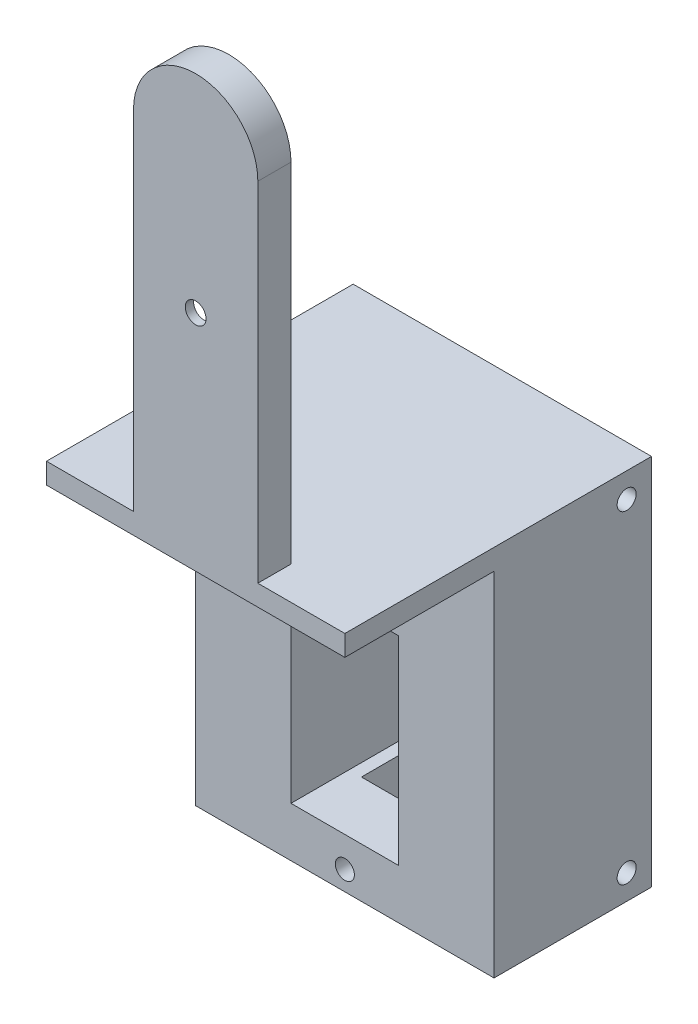
ISO-10303-21;
HEADER;
FILE_DESCRIPTION(('STEP AP214'),'2;1');
FILE_NAME('part.step','',(''),(''),'','','');
FILE_SCHEMA(('AUTOMOTIVE_DESIGN { 1 0 10303 214 1 1 1 1 }'));
ENDSEC;
DATA;
#1=APPLICATION_CONTEXT('core data for automotive mechanical design processes');
#2=APPLICATION_PROTOCOL_DEFINITION('international standard','automotive_design',2000,#1);
#3=PRODUCT_CONTEXT('',#1,'mechanical');
#4=PRODUCT('Part','Part','',(#3));
#5=PRODUCT_RELATED_PRODUCT_CATEGORY('part','',(#4));
#6=PRODUCT_DEFINITION_FORMATION('','',#4);
#7=PRODUCT_DEFINITION_CONTEXT('part definition',#1,'design');
#8=PRODUCT_DEFINITION('design','',#6,#7);
#9=PRODUCT_DEFINITION_SHAPE('','',#8);
#10=(LENGTH_UNIT() NAMED_UNIT(*) SI_UNIT(.MILLI.,.METRE.));
#11=(NAMED_UNIT(*) PLANE_ANGLE_UNIT() SI_UNIT($,.RADIAN.));
#12=(NAMED_UNIT(*) SI_UNIT($,.STERADIAN.) SOLID_ANGLE_UNIT());
#13=UNCERTAINTY_MEASURE_WITH_UNIT(LENGTH_MEASURE(1.E-05),#10,'distance_accuracy_value','');
#14=(GEOMETRIC_REPRESENTATION_CONTEXT(3) GLOBAL_UNCERTAINTY_ASSIGNED_CONTEXT((#13)) GLOBAL_UNIT_ASSIGNED_CONTEXT((#10,
#11,#12)) REPRESENTATION_CONTEXT('',''));
#15=CARTESIAN_POINT('',(0.,0.,0.));
#16=DIRECTION('',(0.,0.,1.));
#17=DIRECTION('',(1.,0.,0.));
#18=AXIS2_PLACEMENT_3D('',#15,#16,#17);
#19=CARTESIAN_POINT('',(-18.,-35.,-33.));
#20=DIRECTION('',(0.,-1.,0.));
#21=DIRECTION('',(0.,0.,-1.));
#22=AXIS2_PLACEMENT_3D('',#19,#20,#21);
#23=PLANE('',#22);
#24=DIRECTION('',(0.,0.,1.));
#25=VECTOR('',#24,1.);
#26=CARTESIAN_POINT('',(5.,-35.,-29.));
#27=LINE('',#26,#25);
#28=CARTESIAN_POINT('',(5.,-35.,-29.));
#29=VERTEX_POINT('',#28);
#30=CARTESIAN_POINT('',(5.,-35.,-21.));
#31=VERTEX_POINT('',#30);
#32=EDGE_CURVE('E815',#29,#31,#27,.T.);
#33=ORIENTED_EDGE('',*,*,#32,.F.);
#34=DIRECTION('',(1.,0.,0.));
#35=VECTOR('',#34,1.);
#36=CARTESIAN_POINT('',(5.,-35.,-29.));
#37=LINE('',#36,#35);
#38=CARTESIAN_POINT('',(-5.,-35.,-29.));
#39=VERTEX_POINT('',#38);
#40=EDGE_CURVE('E821',#39,#29,#37,.T.);
#41=ORIENTED_EDGE('',*,*,#40,.F.);
#42=DIRECTION('',(0.,0.,-1.));
#43=VECTOR('',#42,1.);
#44=CARTESIAN_POINT('',(-5.,-35.,-29.));
#45=LINE('',#44,#43);
#46=CARTESIAN_POINT('',(-5.,-35.,-21.));
#47=VERTEX_POINT('',#46);
#48=EDGE_CURVE('E331',#47,#39,#45,.T.);
#49=ORIENTED_EDGE('',*,*,#48,.F.);
#50=DIRECTION('',(-1.,0.,0.));
#51=VECTOR('',#50,1.);
#52=CARTESIAN_POINT('',(5.,-35.,-21.));
#53=LINE('',#52,#51);
#54=EDGE_CURVE('E817',#31,#47,#53,.T.);
#55=ORIENTED_EDGE('',*,*,#54,.F.);
#56=EDGE_LOOP('',(#33,#41,#49,#55));
#57=FACE_BOUND('',#56,.T.);
#58=DIRECTION('',(0.,0.,1.));
#59=VECTOR('',#58,1.);
#60=CARTESIAN_POINT('',(18.,-35.,-33.));
#61=LINE('',#60,#59);
#62=CARTESIAN_POINT('',(18.,-35.,-33.));
#63=VERTEX_POINT('',#62);
#64=CARTESIAN_POINT('',(18.,-35.,-14.));
#65=VERTEX_POINT('',#64);
#66=EDGE_CURVE('E210',#63,#65,#61,.T.);
#67=ORIENTED_EDGE('',*,*,#66,.T.);
#68=DIRECTION('',(1.,0.,0.));
#69=VECTOR('',#68,1.);
#70=CARTESIAN_POINT('',(-18.,-35.,-14.));
#71=LINE('',#70,#69);
#72=CARTESIAN_POINT('',(-18.,-35.,-14.));
#73=VERTEX_POINT('',#72);
#74=EDGE_CURVE('E196',#73,#65,#71,.T.);
#75=ORIENTED_EDGE('',*,*,#74,.F.);
#76=DIRECTION('',(0.,0.,1.));
#77=VECTOR('',#76,1.);
#78=CARTESIAN_POINT('',(-18.,-35.,-33.));
#79=LINE('',#78,#77);
#80=CARTESIAN_POINT('',(-18.,-35.,-33.));
#81=VERTEX_POINT('',#80);
#82=EDGE_CURVE('E220',#81,#73,#79,.T.);
#83=ORIENTED_EDGE('',*,*,#82,.F.);
#84=DIRECTION('',(1.,0.,0.));
#85=VECTOR('',#84,1.);
#86=CARTESIAN_POINT('',(-18.,-35.,-33.));
#87=LINE('',#86,#85);
#88=EDGE_CURVE('E218',#81,#63,#87,.T.);
#89=ORIENTED_EDGE('',*,*,#88,.T.);
#90=EDGE_LOOP('',(#67,#75,#83,#89));
#91=FACE_BOUND('',#90,.T.);
#92=ADVANCED_FACE('F37',(#57,#91),#23,.T.);
#93=CARTESIAN_POINT('',(6.5,-5.,-31.));
#94=DIRECTION('',(-1.,0.,0.));
#95=DIRECTION('',(0.,-1.,0.));
#96=AXIS2_PLACEMENT_3D('',#93,#94,#95);
#97=PLANE('',#96);
#98=DIRECTION('',(0.,0.,1.));
#99=VECTOR('',#98,1.);
#100=CARTESIAN_POINT('',(6.5,-29.,-31.));
#101=LINE('',#100,#99);
#102=CARTESIAN_POINT('',(6.5,-29.,-31.));
#103=VERTEX_POINT('',#102);
#104=CARTESIAN_POINT('',(6.5,-29.,-14.));
#105=VERTEX_POINT('',#104);
#106=EDGE_CURVE('E366',#103,#105,#101,.T.);
#107=ORIENTED_EDGE('',*,*,#106,.T.);
#108=DIRECTION('',(0.,1.,0.));
#109=VECTOR('',#108,1.);
#110=CARTESIAN_POINT('',(6.5,-5.,-14.));
#111=LINE('',#110,#109);
#112=CARTESIAN_POINT('',(6.5,-5.,-14.));
#113=VERTEX_POINT('',#112);
#114=EDGE_CURVE('E812',#105,#113,#111,.T.);
#115=ORIENTED_EDGE('',*,*,#114,.T.);
#116=DIRECTION('',(0.,0.,1.));
#117=VECTOR('',#116,1.);
#118=CARTESIAN_POINT('',(6.5,-5.,-31.));
#119=LINE('',#118,#117);
#120=CARTESIAN_POINT('',(6.5,-5.,-31.));
#121=VERTEX_POINT('',#120);
#122=EDGE_CURVE('E357',#121,#113,#119,.T.);
#123=ORIENTED_EDGE('',*,*,#122,.F.);
#124=DIRECTION('',(0.,-1.,0.));
#125=VECTOR('',#124,1.);
#126=CARTESIAN_POINT('',(6.5,-5.,-31.));
#127=LINE('',#126,#125);
#128=EDGE_CURVE('E343',#121,#103,#127,.T.);
#129=ORIENTED_EDGE('',*,*,#128,.T.);
#130=EDGE_LOOP('',(#107,#115,#123,#129));
#131=FACE_BOUND('',#130,.T.);
#132=ADVANCED_FACE('F424',(#131),#97,.T.);
#133=CARTESIAN_POINT('',(6.5,-29.,-31.));
#134=DIRECTION('',(0.,1.,0.));
#135=DIRECTION('',(0.,0.,1.));
#136=AXIS2_PLACEMENT_3D('',#133,#134,#135);
#137=PLANE('',#136);
#138=DIRECTION('',(0.,0.,-1.));
#139=VECTOR('',#138,1.);
#140=CARTESIAN_POINT('',(5.,-29.,-31.));
#141=LINE('',#140,#139);
#142=CARTESIAN_POINT('',(5.,-29.,-21.));
#143=VERTEX_POINT('',#142);
#144=CARTESIAN_POINT('',(5.,-29.,-29.));
#145=VERTEX_POINT('',#144);
#146=EDGE_CURVE('E11',#143,#145,#141,.T.);
#147=ORIENTED_EDGE('',*,*,#146,.F.);
#148=DIRECTION('',(1.,0.,0.));
#149=VECTOR('',#148,1.);
#150=CARTESIAN_POINT('',(6.5,-29.,-21.));
#151=LINE('',#150,#149);
#152=CARTESIAN_POINT('',(-5.,-29.,-21.));
#153=VERTEX_POINT('',#152);
#154=EDGE_CURVE('E312',#153,#143,#151,.T.);
#155=ORIENTED_EDGE('',*,*,#154,.F.);
#156=DIRECTION('',(0.,0.,1.));
#157=VECTOR('',#156,1.);
#158=CARTESIAN_POINT('',(-5.,-29.,-31.));
#159=LINE('',#158,#157);
#160=CARTESIAN_POINT('',(-5.,-29.,-29.));
#161=VERTEX_POINT('',#160);
#162=EDGE_CURVE('E306',#161,#153,#159,.T.);
#163=ORIENTED_EDGE('',*,*,#162,.F.);
#164=DIRECTION('',(-1.,0.,0.));
#165=VECTOR('',#164,1.);
#166=CARTESIAN_POINT('',(6.49999999999999,-29.,-29.));
#167=LINE('',#166,#165);
#168=EDGE_CURVE('E46',#145,#161,#167,.T.);
#169=ORIENTED_EDGE('',*,*,#168,.F.);
#170=EDGE_LOOP('',(#147,#155,#163,#169));
#171=FACE_BOUND('',#170,.T.);
#172=DIRECTION('',(0.,0.,1.));
#173=VECTOR('',#172,1.);
#174=CARTESIAN_POINT('',(-6.50000000000001,-29.,-31.));
#175=LINE('',#174,#173);
#176=CARTESIAN_POINT('',(-6.50000000000001,-29.,-31.));
#177=VERTEX_POINT('',#176);
#178=CARTESIAN_POINT('',(-6.50000000000001,-29.,-14.));
#179=VERTEX_POINT('',#178);
#180=EDGE_CURVE('E363',#177,#179,#175,.T.);
#181=ORIENTED_EDGE('',*,*,#180,.T.);
#182=DIRECTION('',(1.,0.,0.));
#183=VECTOR('',#182,1.);
#184=CARTESIAN_POINT('',(6.5,-29.,-14.));
#185=LINE('',#184,#183);
#186=EDGE_CURVE('E809',#179,#105,#185,.T.);
#187=ORIENTED_EDGE('',*,*,#186,.T.);
#188=ORIENTED_EDGE('',*,*,#106,.F.);
#189=DIRECTION('',(-1.,0.,0.));
#190=VECTOR('',#189,1.);
#191=CARTESIAN_POINT('',(6.5,-29.,-31.));
#192=LINE('',#191,#190);
#193=EDGE_CURVE('E351',#103,#177,#192,.T.);
#194=ORIENTED_EDGE('',*,*,#193,.T.);
#195=EDGE_LOOP('',(#181,#187,#188,#194));
#196=FACE_BOUND('',#195,.T.);
#197=ADVANCED_FACE('F335',(#171,#196),#137,.T.);
#198=CARTESIAN_POINT('',(-6.5,-5.,-31.));
#199=DIRECTION('',(1.,0.,0.));
#200=DIRECTION('',(0.,1.,0.));
#201=AXIS2_PLACEMENT_3D('',#198,#199,#200);
#202=PLANE('',#201);
#203=DIRECTION('',(0.,0.,1.));
#204=VECTOR('',#203,1.);
#205=CARTESIAN_POINT('',(-6.5,-5.,-31.));
#206=LINE('',#205,#204);
#207=CARTESIAN_POINT('',(-6.5,-5.,-31.));
#208=VERTEX_POINT('',#207);
#209=CARTESIAN_POINT('',(-6.5,-5.,-14.));
#210=VERTEX_POINT('',#209);
#211=EDGE_CURVE('E360',#208,#210,#206,.T.);
#212=ORIENTED_EDGE('',*,*,#211,.T.);
#213=DIRECTION('',(0.,-1.,0.));
#214=VECTOR('',#213,1.);
#215=CARTESIAN_POINT('',(-6.5,-5.,-14.));
#216=LINE('',#215,#214);
#217=EDGE_CURVE('E61',#210,#179,#216,.T.);
#218=ORIENTED_EDGE('',*,*,#217,.T.);
#219=ORIENTED_EDGE('',*,*,#180,.F.);
#220=DIRECTION('',(0.,1.,0.));
#221=VECTOR('',#220,1.);
#222=CARTESIAN_POINT('',(-6.5,-5.,-31.));
#223=LINE('',#222,#221);
#224=EDGE_CURVE('E353',#177,#208,#223,.T.);
#225=ORIENTED_EDGE('',*,*,#224,.T.);
#226=EDGE_LOOP('',(#212,#218,#219,#225));
#227=FACE_BOUND('',#226,.T.);
#228=ADVANCED_FACE('F705',(#227),#202,.T.);
#229=CARTESIAN_POINT('',(6.5,-5.,-31.));
#230=DIRECTION('',(0.,-1.,0.));
#231=DIRECTION('',(0.,0.,-1.));
#232=AXIS2_PLACEMENT_3D('',#229,#230,#231);
#233=PLANE('',#232);
#234=ORIENTED_EDGE('',*,*,#122,.T.);
#235=DIRECTION('',(-1.,0.,0.));
#236=VECTOR('',#235,1.);
#237=CARTESIAN_POINT('',(6.5,-5.,-14.));
#238=LINE('',#237,#236);
#239=EDGE_CURVE('E801',#113,#210,#238,.T.);
#240=ORIENTED_EDGE('',*,*,#239,.T.);
#241=ORIENTED_EDGE('',*,*,#211,.F.);
#242=DIRECTION('',(1.,0.,0.));
#243=VECTOR('',#242,1.);
#244=CARTESIAN_POINT('',(6.5,-5.,-31.));
#245=LINE('',#244,#243);
#246=EDGE_CURVE('E355',#208,#121,#245,.T.);
#247=ORIENTED_EDGE('',*,*,#246,.T.);
#248=EDGE_LOOP('',(#234,#240,#241,#247));
#249=FACE_BOUND('',#248,.T.);
#250=ADVANCED_FACE('F713',(#249),#233,.T.);
#251=CARTESIAN_POINT('',(0.,-32.65,-27.));
#252=DIRECTION('',(0.,0.,1.));
#253=DIRECTION('',(1.,0.,0.));
#254=AXIS2_PLACEMENT_3D('',#251,#252,#253);
#255=CYLINDRICAL_SURFACE('',#254,1.15);
#256=CARTESIAN_POINT('',(0.,-32.65,-21.));
#257=DIRECTION('',(0.,0.,1.));
#258=DIRECTION('',(1.,0.,0.));
#259=AXIS2_PLACEMENT_3D('',#256,#257,#258);
#260=CIRCLE('',#259,1.15);
#261=CARTESIAN_POINT('',(1.15000000000001,-32.65,-21.));
#262=VERTEX_POINT('',#261);
#263=EDGE_CURVE('E309',#262,#262,#260,.F.);
#264=ORIENTED_EDGE('',*,*,#263,.T.);
#265=EDGE_LOOP('',(#264));
#266=FACE_BOUND('',#265,.T.);
#267=CARTESIAN_POINT('',(0.,-32.65,-14.));
#268=DIRECTION('',(0.,0.,1.));
#269=DIRECTION('',(1.,0.,0.));
#270=AXIS2_PLACEMENT_3D('',#267,#268,#269);
#271=CIRCLE('',#270,1.15);
#272=CARTESIAN_POINT('',(1.15000000000001,-32.65,-14.));
#273=VERTEX_POINT('',#272);
#274=EDGE_CURVE('E799',#273,#273,#271,.F.);
#275=ORIENTED_EDGE('',*,*,#274,.F.);
#276=EDGE_LOOP('',(#275));
#277=FACE_BOUND('',#276,.T.);
#278=ADVANCED_FACE('F421',(#266,#277),#255,.F.);
#279=CARTESIAN_POINT('',(0.,52.,4.));
#280=DIRECTION('',(0.,0.,1.));
#281=DIRECTION('',(1.,0.,0.));
#282=AXIS2_PLACEMENT_3D('',#279,#280,#281);
#283=PLANE('',#282);
#284=DIRECTION('',(-1.,0.,0.));
#285=VECTOR('',#284,1.);
#286=CARTESIAN_POINT('',(-18.,7.5,4.));
#287=LINE('',#286,#285);
#288=CARTESIAN_POINT('',(18.,7.5,4.));
#289=VERTEX_POINT('',#288);
#290=CARTESIAN_POINT('',(-18.,7.5,4.));
#291=VERTEX_POINT('',#290);
#292=EDGE_CURVE('E401',#289,#291,#287,.T.);
#293=ORIENTED_EDGE('',*,*,#292,.F.);
#294=DIRECTION('',(0.,1.,0.));
#295=VECTOR('',#294,1.);
#296=CARTESIAN_POINT('',(18.,10.,4.));
#297=LINE('',#296,#295);
#298=CARTESIAN_POINT('',(18.,10.,4.));
#299=VERTEX_POINT('',#298);
#300=EDGE_CURVE('E381',#289,#299,#297,.T.);
#301=ORIENTED_EDGE('',*,*,#300,.T.);
#302=DIRECTION('',(-1.,0.,0.));
#303=VECTOR('',#302,1.);
#304=CARTESIAN_POINT('',(-18.,10.,4.));
#305=LINE('',#304,#303);
#306=CARTESIAN_POINT('',(7.5,10.,4.));
#307=VERTEX_POINT('',#306);
#308=EDGE_CURVE('E373',#299,#307,#305,.T.);
#309=ORIENTED_EDGE('',*,*,#308,.T.);
#310=DIRECTION('',(0.,1.,0.));
#311=VECTOR('',#310,1.);
#312=CARTESIAN_POINT('',(7.5,10.,4.));
#313=LINE('',#312,#311);
#314=CARTESIAN_POINT('',(7.5,52.,4.));
#315=VERTEX_POINT('',#314);
#316=EDGE_CURVE('E284',#307,#315,#313,.T.);
#317=ORIENTED_EDGE('',*,*,#316,.T.);
#318=CARTESIAN_POINT('',(0.,52.,4.));
#319=DIRECTION('',(0.,0.,1.));
#320=DIRECTION('',(1.,0.,0.));
#321=AXIS2_PLACEMENT_3D('',#318,#319,#320);
#322=CIRCLE('',#321,7.5);
#323=CARTESIAN_POINT('',(-7.5,52.,4.));
#324=VERTEX_POINT('',#323);
#325=EDGE_CURVE('E278',#315,#324,#322,.T.);
#326=ORIENTED_EDGE('',*,*,#325,.T.);
#327=DIRECTION('',(0.,-1.,0.));
#328=VECTOR('',#327,1.);
#329=CARTESIAN_POINT('',(-7.5,10.,4.));
#330=LINE('',#329,#328);
#331=CARTESIAN_POINT('',(-7.5,10.,4.));
#332=VERTEX_POINT('',#331);
#333=EDGE_CURVE('E281',#324,#332,#330,.T.);
#334=ORIENTED_EDGE('',*,*,#333,.T.);
#335=CARTESIAN_POINT('',(-18.,10.,4.));
#336=VERTEX_POINT('',#335);
#337=EDGE_CURVE('E383',#332,#336,#305,.T.);
#338=ORIENTED_EDGE('',*,*,#337,.T.);
#339=DIRECTION('',(0.,-1.,0.));
#340=VECTOR('',#339,1.);
#341=CARTESIAN_POINT('',(-18.,10.,4.));
#342=LINE('',#341,#340);
#343=EDGE_CURVE('E369',#336,#291,#342,.T.);
#344=ORIENTED_EDGE('',*,*,#343,.T.);
#345=EDGE_LOOP('',(#293,#301,#309,#317,#326,#334,#338,#344));
#346=FACE_BOUND('',#345,.T.);
#347=CARTESIAN_POINT('',(0.,34.5,4.));
#348=DIRECTION('',(0.,0.,1.));
#349=DIRECTION('',(1.,0.,0.));
#350=AXIS2_PLACEMENT_3D('',#347,#348,#349);
#351=CIRCLE('',#350,1.25);
#352=CARTESIAN_POINT('',(1.25,34.5,4.));
#353=VERTEX_POINT('',#352);
#354=EDGE_CURVE('E229',#353,#353,#351,.F.);
#355=ORIENTED_EDGE('',*,*,#354,.T.);
#356=EDGE_LOOP('',(#355));
#357=FACE_BOUND('',#356,.T.);
#358=ADVANCED_FACE('F399',(#346,#357),#283,.T.);
#359=CARTESIAN_POINT('',(0.,52.,4.));
#360=DIRECTION('',(0.,0.,-1.));
#361=DIRECTION('',(-1.,0.,0.));
#362=AXIS2_PLACEMENT_3D('',#359,#360,#361);
#363=CYLINDRICAL_SURFACE('',#362,7.5);
#364=CARTESIAN_POINT('',(0.,52.,0.));
#365=DIRECTION('',(0.,0.,1.));
#366=DIRECTION('',(1.,0.,0.));
#367=AXIS2_PLACEMENT_3D('',#364,#365,#366);
#368=CIRCLE('',#367,7.5);
#369=CARTESIAN_POINT('',(7.5,52.,0.));
#370=VERTEX_POINT('',#369);
#371=CARTESIAN_POINT('',(-7.5,52.,0.));
#372=VERTEX_POINT('',#371);
#373=EDGE_CURVE('E277',#370,#372,#368,.T.);
#374=ORIENTED_EDGE('',*,*,#373,.T.);
#375=DIRECTION('',(0.,0.,-1.));
#376=VECTOR('',#375,1.);
#377=CARTESIAN_POINT('',(-7.5,52.,4.));
#378=LINE('',#377,#376);
#379=EDGE_CURVE('E303',#324,#372,#378,.T.);
#380=ORIENTED_EDGE('',*,*,#379,.F.);
#381=ORIENTED_EDGE('',*,*,#325,.F.);
#382=DIRECTION('',(0.,0.,-1.));
#383=VECTOR('',#382,1.);
#384=CARTESIAN_POINT('',(7.5,52.,4.));
#385=LINE('',#384,#383);
#386=EDGE_CURVE('E286',#315,#370,#385,.T.);
#387=ORIENTED_EDGE('',*,*,#386,.T.);
#388=EDGE_LOOP('',(#374,#380,#381,#387));
#389=FACE_BOUND('',#388,.T.);
#390=ADVANCED_FACE('F39',(#389),#363,.T.);
#391=CARTESIAN_POINT('',(-7.5,10.,4.));
#392=DIRECTION('',(1.,0.,0.));
#393=DIRECTION('',(0.,0.,-1.));
#394=AXIS2_PLACEMENT_3D('',#391,#392,#393);
#395=PLANE('',#394);
#396=DIRECTION('',(0.,-1.,0.));
#397=VECTOR('',#396,1.);
#398=CARTESIAN_POINT('',(-7.5,10.,0.));
#399=LINE('',#398,#397);
#400=CARTESIAN_POINT('',(-7.5,10.,0.));
#401=VERTEX_POINT('',#400);
#402=EDGE_CURVE('E289',#372,#401,#399,.T.);
#403=ORIENTED_EDGE('',*,*,#402,.T.);
#404=DIRECTION('',(0.,0.,-1.));
#405=VECTOR('',#404,1.);
#406=CARTESIAN_POINT('',(-7.5,10.,4.));
#407=LINE('',#406,#405);
#408=EDGE_CURVE('E300',#332,#401,#407,.T.);
#409=ORIENTED_EDGE('',*,*,#408,.F.);
#410=ORIENTED_EDGE('',*,*,#333,.F.);
#411=ORIENTED_EDGE('',*,*,#379,.T.);
#412=EDGE_LOOP('',(#403,#409,#410,#411));
#413=FACE_BOUND('',#412,.T.);
#414=ADVANCED_FACE('F406',(#413),#395,.F.);
#415=CARTESIAN_POINT('',(7.5,10.,4.));
#416=DIRECTION('',(-1.,0.,0.));
#417=DIRECTION('',(0.,0.,1.));
#418=AXIS2_PLACEMENT_3D('',#415,#416,#417);
#419=PLANE('',#418);
#420=DIRECTION('',(0.,1.,0.));
#421=VECTOR('',#420,1.);
#422=CARTESIAN_POINT('',(7.5,10.,0.));
#423=LINE('',#422,#421);
#424=CARTESIAN_POINT('',(7.5,10.,0.));
#425=VERTEX_POINT('',#424);
#426=EDGE_CURVE('E282',#425,#370,#423,.T.);
#427=ORIENTED_EDGE('',*,*,#426,.T.);
#428=ORIENTED_EDGE('',*,*,#386,.F.);
#429=ORIENTED_EDGE('',*,*,#316,.F.);
#430=DIRECTION('',(0.,0.,-1.));
#431=VECTOR('',#430,1.);
#432=CARTESIAN_POINT('',(7.5,10.,4.));
#433=LINE('',#432,#431);
#434=EDGE_CURVE('E298',#307,#425,#433,.T.);
#435=ORIENTED_EDGE('',*,*,#434,.T.);
#436=EDGE_LOOP('',(#427,#428,#429,#435));
#437=FACE_BOUND('',#436,.T.);
#438=ADVANCED_FACE('F414',(#437),#419,.F.);
#439=CARTESIAN_POINT('',(0.,52.,0.));
#440=DIRECTION('',(0.,0.,1.));
#441=DIRECTION('',(1.,0.,0.));
#442=AXIS2_PLACEMENT_3D('',#439,#440,#441);
#443=PLANE('',#442);
#444=DIRECTION('',(-0.161684528353417,0.986842496699009,0.));
#445=VECTOR('',#444,1.);
#446=CARTESIAN_POINT('',(10.3740127119628,1.69968090964534,0.));
#447=LINE('',#446,#445);
#448=CARTESIAN_POINT('',(4.99999999999998,34.5,0.));
#449=VERTEX_POINT('',#448);
#450=CARTESIAN_POINT('',(2.13279550115704,52.,0.));
#451=VERTEX_POINT('',#450);
#452=EDGE_CURVE('E238',#449,#451,#447,.T.);
#453=ORIENTED_EDGE('',*,*,#452,.T.);
#454=CARTESIAN_POINT('',(0.,52.,0.));
#455=DIRECTION('',(0.,0.,1.));
#456=DIRECTION('',(1.,0.,0.));
#457=AXIS2_PLACEMENT_3D('',#454,#455,#456);
#458=CIRCLE('',#457,2.13279550115703);
#459=CARTESIAN_POINT('',(-2.13279550115704,52.,0.));
#460=VERTEX_POINT('',#459);
#461=EDGE_CURVE('E232',#460,#451,#458,.F.);
#462=ORIENTED_EDGE('',*,*,#461,.F.);
#463=DIRECTION('',(-0.16168452835342,-0.986842496699008,0.));
#464=VECTOR('',#463,1.);
#465=CARTESIAN_POINT('',(-10.3740127119629,1.69968090964539,0.));
#466=LINE('',#465,#464);
#467=CARTESIAN_POINT('',(-5.00000000000002,34.5,0.));
#468=VERTEX_POINT('',#467);
#469=EDGE_CURVE('E251',#460,#468,#466,.T.);
#470=ORIENTED_EDGE('',*,*,#469,.T.);
#471=DIRECTION('',(0.161167236733304,-0.986927110684346,0.));
#472=VECTOR('',#471,1.);
#473=CARTESIAN_POINT('',(0.617455268354426,0.100831721339684,0.));
#474=LINE('',#473,#472);
#475=CARTESIAN_POINT('',(-2.14221383494361,17.,0.));
#476=VERTEX_POINT('',#475);
#477=EDGE_CURVE('E254',#468,#476,#474,.T.);
#478=ORIENTED_EDGE('',*,*,#477,.T.);
#479=CARTESIAN_POINT('',(0.,17.,0.));
#480=DIRECTION('',(0.,0.,1.));
#481=DIRECTION('',(1.,0.,0.));
#482=AXIS2_PLACEMENT_3D('',#479,#480,#481);
#483=CIRCLE('',#482,2.14221383494361);
#484=CARTESIAN_POINT('',(2.11474128897981,16.6580213525557,0.));
#485=VERTEX_POINT('',#484);
#486=EDGE_CURVE('E257',#476,#485,#483,.T.);
#487=ORIENTED_EDGE('',*,*,#486,.T.);
#488=DIRECTION('',(-0.159637960443523,-0.987175628541058,0.));
#489=VECTOR('',#488,1.);
#490=CARTESIAN_POINT('',(-0.564300677997595,0.0912540856033568,0.));
#491=LINE('',#490,#489);
#492=EDGE_CURVE('E260',#449,#485,#491,.T.);
#493=ORIENTED_EDGE('',*,*,#492,.F.);
#494=EDGE_LOOP('',(#453,#462,#470,#478,#487,#493));
#495=FACE_BOUND('',#494,.T.);
#496=ORIENTED_EDGE('',*,*,#373,.F.);
#497=ORIENTED_EDGE('',*,*,#426,.F.);
#498=DIRECTION('',(1.,0.,0.));
#499=VECTOR('',#498,1.);
#500=CARTESIAN_POINT('',(7.5,10.,0.));
#501=LINE('',#500,#499);
#502=EDGE_CURVE('E292',#401,#425,#501,.T.);
#503=ORIENTED_EDGE('',*,*,#502,.F.);
#504=ORIENTED_EDGE('',*,*,#402,.F.);
#505=EDGE_LOOP('',(#496,#497,#503,#504));
#506=FACE_BOUND('',#505,.T.);
#507=ADVANCED_FACE('F411',(#495,#506),#443,.F.);
#508=CARTESIAN_POINT('',(0.,52.,3.));
#509=DIRECTION('',(0.,0.,-1.));
#510=DIRECTION('',(-1.,0.,0.));
#511=AXIS2_PLACEMENT_3D('',#508,#509,#510);
#512=CYLINDRICAL_SURFACE('',#511,2.13279550115703);
#513=ORIENTED_EDGE('',*,*,#461,.T.);
#514=DIRECTION('',(0.,0.,-1.));
#515=VECTOR('',#514,1.);
#516=CARTESIAN_POINT('',(2.13279550115704,52.,3.));
#517=LINE('',#516,#515);
#518=CARTESIAN_POINT('',(2.13279550115704,52.,3.));
#519=VERTEX_POINT('',#518);
#520=EDGE_CURVE('E249',#519,#451,#517,.T.);
#521=ORIENTED_EDGE('',*,*,#520,.F.);
#522=CARTESIAN_POINT('',(0.,52.,3.));
#523=DIRECTION('',(0.,0.,1.));
#524=DIRECTION('',(1.,0.,0.));
#525=AXIS2_PLACEMENT_3D('',#522,#523,#524);
#526=CIRCLE('',#525,2.13279550115703);
#527=CARTESIAN_POINT('',(-2.13279550115704,52.,3.));
#528=VERTEX_POINT('',#527);
#529=EDGE_CURVE('E234',#528,#519,#526,.F.);
#530=ORIENTED_EDGE('',*,*,#529,.F.);
#531=DIRECTION('',(0.,0.,-1.));
#532=VECTOR('',#531,1.);
#533=CARTESIAN_POINT('',(-2.13279550115704,52.,3.));
#534=LINE('',#533,#532);
#535=EDGE_CURVE('E275',#528,#460,#534,.T.);
#536=ORIENTED_EDGE('',*,*,#535,.T.);
#537=EDGE_LOOP('',(#513,#521,#530,#536));
#538=FACE_BOUND('',#537,.T.);
#539=ADVANCED_FACE('F466',(#538),#512,.F.);
#540=CARTESIAN_POINT('',(-10.3740127119629,1.69968090964539,3.));
#541=DIRECTION('',(0.986842496699008,-0.16168452835342,0.));
#542=DIRECTION('',(0.16168452835342,0.986842496699008,0.));
#543=AXIS2_PLACEMENT_3D('',#540,#541,#542);
#544=PLANE('',#543);
#545=ORIENTED_EDGE('',*,*,#469,.F.);
#546=ORIENTED_EDGE('',*,*,#535,.F.);
#547=DIRECTION('',(-0.16168452835342,-0.986842496699008,0.));
#548=VECTOR('',#547,1.);
#549=CARTESIAN_POINT('',(-10.3740127119629,1.69968090964539,3.));
#550=LINE('',#549,#548);
#551=CARTESIAN_POINT('',(-5.00000000000002,34.5,3.));
#552=VERTEX_POINT('',#551);
#553=EDGE_CURVE('E237',#528,#552,#550,.T.);
#554=ORIENTED_EDGE('',*,*,#553,.T.);
#555=DIRECTION('',(0.,0.,-1.));
#556=VECTOR('',#555,1.);
#557=CARTESIAN_POINT('',(-5.00000000000002,34.5,3.));
#558=LINE('',#557,#556);
#559=EDGE_CURVE('E273',#552,#468,#558,.T.);
#560=ORIENTED_EDGE('',*,*,#559,.T.);
#561=EDGE_LOOP('',(#545,#546,#554,#560));
#562=FACE_BOUND('',#561,.T.);
#563=ADVANCED_FACE('F462',(#562),#544,.T.);
#564=CARTESIAN_POINT('',(0.617455268354426,0.100831721339684,3.));
#565=DIRECTION('',(0.986927110684346,0.161167236733304,0.));
#566=DIRECTION('',(-0.161167236733304,0.986927110684346,0.));
#567=AXIS2_PLACEMENT_3D('',#564,#565,#566);
#568=PLANE('',#567);
#569=ORIENTED_EDGE('',*,*,#477,.F.);
#570=ORIENTED_EDGE('',*,*,#559,.F.);
#571=DIRECTION('',(0.161167236733304,-0.986927110684346,0.));
#572=VECTOR('',#571,1.);
#573=CARTESIAN_POINT('',(0.617455268354426,0.100831721339684,3.));
#574=LINE('',#573,#572);
#575=CARTESIAN_POINT('',(-2.14221383494361,17.,3.));
#576=VERTEX_POINT('',#575);
#577=EDGE_CURVE('E240',#552,#576,#574,.T.);
#578=ORIENTED_EDGE('',*,*,#577,.T.);
#579=DIRECTION('',(0.,0.,-1.));
#580=VECTOR('',#579,1.);
#581=CARTESIAN_POINT('',(-2.14221383494361,17.,3.));
#582=LINE('',#581,#580);
#583=EDGE_CURVE('E271',#576,#476,#582,.T.);
#584=ORIENTED_EDGE('',*,*,#583,.T.);
#585=EDGE_LOOP('',(#569,#570,#578,#584));
#586=FACE_BOUND('',#585,.T.);
#587=ADVANCED_FACE('F458',(#586),#568,.T.);
#588=CARTESIAN_POINT('',(0.,17.,3.));
#589=DIRECTION('',(0.,0.,-1.));
#590=DIRECTION('',(-1.,0.,0.));
#591=AXIS2_PLACEMENT_3D('',#588,#589,#590);
#592=CYLINDRICAL_SURFACE('',#591,2.14221383494361);
#593=ORIENTED_EDGE('',*,*,#486,.F.);
#594=ORIENTED_EDGE('',*,*,#583,.F.);
#595=CARTESIAN_POINT('',(0.,17.,3.));
#596=DIRECTION('',(0.,0.,1.));
#597=DIRECTION('',(1.,0.,0.));
#598=AXIS2_PLACEMENT_3D('',#595,#596,#597);
#599=CIRCLE('',#598,2.14221383494361);
#600=CARTESIAN_POINT('',(2.11474128897981,16.6580213525557,3.));
#601=VERTEX_POINT('',#600);
#602=EDGE_CURVE('E242',#576,#601,#599,.T.);
#603=ORIENTED_EDGE('',*,*,#602,.T.);
#604=DIRECTION('',(0.,0.,-1.));
#605=VECTOR('',#604,1.);
#606=CARTESIAN_POINT('',(2.11474128897981,16.6580213525557,3.));
#607=LINE('',#606,#605);
#608=EDGE_CURVE('E269',#601,#485,#607,.T.);
#609=ORIENTED_EDGE('',*,*,#608,.T.);
#610=EDGE_LOOP('',(#593,#594,#603,#609));
#611=FACE_BOUND('',#610,.T.);
#612=ADVANCED_FACE('F454',(#611),#592,.F.);
#613=CARTESIAN_POINT('',(-0.564300677997595,0.0912540856033568,3.));
#614=DIRECTION('',(0.987175628541058,-0.159637960443523,0.));
#615=DIRECTION('',(0.159637960443523,0.987175628541058,0.));
#616=AXIS2_PLACEMENT_3D('',#613,#614,#615);
#617=PLANE('',#616);
#618=ORIENTED_EDGE('',*,*,#492,.T.);
#619=ORIENTED_EDGE('',*,*,#608,.F.);
#620=DIRECTION('',(-0.159637960443523,-0.987175628541058,0.));
#621=VECTOR('',#620,1.);
#622=CARTESIAN_POINT('',(-0.564300677997595,0.0912540856033568,3.));
#623=LINE('',#622,#621);
#624=CARTESIAN_POINT('',(4.99999999999998,34.5,3.));
#625=VERTEX_POINT('',#624);
#626=EDGE_CURVE('E244',#625,#601,#623,.T.);
#627=ORIENTED_EDGE('',*,*,#626,.F.);
#628=DIRECTION('',(0.,0.,-1.));
#629=VECTOR('',#628,1.);
#630=CARTESIAN_POINT('',(4.99999999999998,34.5,3.));
#631=LINE('',#630,#629);
#632=EDGE_CURVE('E267',#625,#449,#631,.T.);
#633=ORIENTED_EDGE('',*,*,#632,.T.);
#634=EDGE_LOOP('',(#618,#619,#627,#633));
#635=FACE_BOUND('',#634,.T.);
#636=ADVANCED_FACE('F450',(#635),#617,.F.);
#637=CARTESIAN_POINT('',(10.3740127119628,1.69968090964534,3.));
#638=DIRECTION('',(-0.986842496699009,-0.161684528353417,0.));
#639=DIRECTION('',(0.161684528353417,-0.986842496699009,0.));
#640=AXIS2_PLACEMENT_3D('',#637,#638,#639);
#641=PLANE('',#640);
#642=ORIENTED_EDGE('',*,*,#452,.F.);
#643=ORIENTED_EDGE('',*,*,#632,.F.);
#644=DIRECTION('',(-0.161684528353417,0.986842496699009,0.));
#645=VECTOR('',#644,1.);
#646=CARTESIAN_POINT('',(10.3740127119628,1.69968090964534,3.));
#647=LINE('',#646,#645);
#648=EDGE_CURVE('E247',#625,#519,#647,.T.);
#649=ORIENTED_EDGE('',*,*,#648,.T.);
#650=ORIENTED_EDGE('',*,*,#520,.T.);
#651=EDGE_LOOP('',(#642,#643,#649,#650));
#652=FACE_BOUND('',#651,.T.);
#653=ADVANCED_FACE('F446',(#652),#641,.T.);
#654=CARTESIAN_POINT('',(0.,0.,3.));
#655=DIRECTION('',(0.,0.,1.));
#656=DIRECTION('',(1.,0.,0.));
#657=AXIS2_PLACEMENT_3D('',#654,#655,#656);
#658=PLANE('',#657);
#659=CARTESIAN_POINT('',(0.,34.5,3.));
#660=DIRECTION('',(0.,0.,1.));
#661=DIRECTION('',(1.,0.,0.));
#662=AXIS2_PLACEMENT_3D('',#659,#660,#661);
#663=CIRCLE('',#662,1.25);
#664=CARTESIAN_POINT('',(1.25,34.5,3.));
#665=VERTEX_POINT('',#664);
#666=EDGE_CURVE('E233',#665,#665,#663,.F.);
#667=ORIENTED_EDGE('',*,*,#666,.F.);
#668=EDGE_LOOP('',(#667));
#669=FACE_BOUND('',#668,.T.);
#670=ORIENTED_EDGE('',*,*,#529,.T.);
#671=ORIENTED_EDGE('',*,*,#648,.F.);
#672=ORIENTED_EDGE('',*,*,#626,.T.);
#673=ORIENTED_EDGE('',*,*,#602,.F.);
#674=ORIENTED_EDGE('',*,*,#577,.F.);
#675=ORIENTED_EDGE('',*,*,#553,.F.);
#676=EDGE_LOOP('',(#670,#671,#672,#673,#674,#675));
#677=FACE_BOUND('',#676,.T.);
#678=ADVANCED_FACE('F442',(#669,#677),#658,.F.);
#679=CARTESIAN_POINT('',(0.,34.5,12.4));
#680=DIRECTION('',(0.,0.,-1.));
#681=DIRECTION('',(-1.,0.,0.));
#682=AXIS2_PLACEMENT_3D('',#679,#680,#681);
#683=CYLINDRICAL_SURFACE('',#682,1.25);
#684=ORIENTED_EDGE('',*,*,#354,.F.);
#685=EDGE_LOOP('',(#684));
#686=FACE_BOUND('',#685,.T.);
#687=ORIENTED_EDGE('',*,*,#666,.T.);
#688=EDGE_LOOP('',(#687));
#689=FACE_BOUND('',#688,.T.);
#690=ADVANCED_FACE('F439',(#686,#689),#683,.F.);
#691=CARTESIAN_POINT('',(-18.,10.,-33.));
#692=DIRECTION('',(0.,1.,0.));
#693=DIRECTION('',(0.,0.,1.));
#694=AXIS2_PLACEMENT_3D('',#691,#692,#693);
#695=PLANE('',#694);
#696=ORIENTED_EDGE('',*,*,#434,.F.);
#697=ORIENTED_EDGE('',*,*,#308,.F.);
#698=DIRECTION('',(0.,0.,1.));
#699=VECTOR('',#698,1.);
#700=CARTESIAN_POINT('',(18.,10.,-33.));
#701=LINE('',#700,#699);
#702=CARTESIAN_POINT('',(18.,10.,-33.));
#703=VERTEX_POINT('',#702);
#704=EDGE_CURVE('E219',#703,#299,#701,.T.);
#705=ORIENTED_EDGE('',*,*,#704,.F.);
#706=DIRECTION('',(-1.,0.,0.));
#707=VECTOR('',#706,1.);
#708=CARTESIAN_POINT('',(-18.,10.,-33.));
#709=LINE('',#708,#707);
#710=CARTESIAN_POINT('',(-18.,10.,-33.));
#711=VERTEX_POINT('',#710);
#712=EDGE_CURVE('E225',#703,#711,#709,.T.);
#713=ORIENTED_EDGE('',*,*,#712,.T.);
#714=DIRECTION('',(0.,0.,1.));
#715=VECTOR('',#714,1.);
#716=CARTESIAN_POINT('',(-18.,10.,-33.));
#717=LINE('',#716,#715);
#718=EDGE_CURVE('E223',#711,#336,#717,.T.);
#719=ORIENTED_EDGE('',*,*,#718,.T.);
#720=ORIENTED_EDGE('',*,*,#337,.F.);
#721=ORIENTED_EDGE('',*,*,#408,.T.);
#722=ORIENTED_EDGE('',*,*,#502,.T.);
#723=EDGE_LOOP('',(#696,#697,#705,#713,#719,#720,#721,#722));
#724=FACE_BOUND('',#723,.T.);
#725=ADVANCED_FACE('F390',(#724),#695,.T.);
#726=CARTESIAN_POINT('',(-18.,10.,-33.));
#727=DIRECTION('',(-1.,0.,0.));
#728=DIRECTION('',(0.,-1.,0.));
#729=AXIS2_PLACEMENT_3D('',#726,#727,#728);
#730=PLANE('',#729);
#731=CARTESIAN_POINT('',(-18.,7.,-30.));
#732=DIRECTION('',(-1.,0.,0.));
#733=DIRECTION('',(0.,-1.,0.));
#734=AXIS2_PLACEMENT_3D('',#731,#732,#733);
#735=CIRCLE('',#734,1.15);
#736=CARTESIAN_POINT('',(-18.,5.85,-30.));
#737=VERTEX_POINT('',#736);
#738=EDGE_CURVE('E844',#737,#737,#735,.T.);
#739=ORIENTED_EDGE('',*,*,#738,.F.);
#740=EDGE_LOOP('',(#739));
#741=FACE_BOUND('',#740,.T.);
#742=CARTESIAN_POINT('',(-18.,-32.,-30.));
#743=DIRECTION('',(-1.,0.,0.));
#744=DIRECTION('',(0.,-1.,0.));
#745=AXIS2_PLACEMENT_3D('',#742,#743,#744);
#746=CIRCLE('',#745,1.15);
#747=CARTESIAN_POINT('',(-18.,-33.15,-30.));
#748=VERTEX_POINT('',#747);
#749=EDGE_CURVE('E837',#748,#748,#746,.T.);
#750=ORIENTED_EDGE('',*,*,#749,.F.);
#751=EDGE_LOOP('',(#750));
#752=FACE_BOUND('',#751,.T.);
#753=DIRECTION('',(0.,0.,1.));
#754=VECTOR('',#753,1.);
#755=CARTESIAN_POINT('',(-18.,7.5,-14.));
#756=LINE('',#755,#754);
#757=CARTESIAN_POINT('',(-18.,7.5,-14.));
#758=VERTEX_POINT('',#757);
#759=EDGE_CURVE('E396',#758,#291,#756,.T.);
#760=ORIENTED_EDGE('',*,*,#759,.T.);
#761=ORIENTED_EDGE('',*,*,#343,.F.);
#762=ORIENTED_EDGE('',*,*,#718,.F.);
#763=DIRECTION('',(0.,-1.,0.));
#764=VECTOR('',#763,1.);
#765=CARTESIAN_POINT('',(-18.,10.,-33.));
#766=LINE('',#765,#764);
#767=EDGE_CURVE('E370',#711,#81,#766,.T.);
#768=ORIENTED_EDGE('',*,*,#767,.T.);
#769=ORIENTED_EDGE('',*,*,#82,.T.);
#770=DIRECTION('',(0.,-1.,0.));
#771=VECTOR('',#770,1.);
#772=CARTESIAN_POINT('',(-18.,7.5,-14.));
#773=LINE('',#772,#771);
#774=EDGE_CURVE('E53',#758,#73,#773,.T.);
#775=ORIENTED_EDGE('',*,*,#774,.F.);
#776=EDGE_LOOP('',(#760,#761,#762,#768,#769,#775));
#777=FACE_BOUND('',#776,.T.);
#778=ADVANCED_FACE('F395',(#741,#752,#777),#730,.T.);
#779=CARTESIAN_POINT('',(18.,10.,-33.));
#780=DIRECTION('',(1.,0.,0.));
#781=DIRECTION('',(0.,1.,0.));
#782=AXIS2_PLACEMENT_3D('',#779,#780,#781);
#783=PLANE('',#782);
#784=CARTESIAN_POINT('',(18.,7.,-30.));
#785=DIRECTION('',(1.,0.,0.));
#786=DIRECTION('',(0.,1.,0.));
#787=AXIS2_PLACEMENT_3D('',#784,#785,#786);
#788=CIRCLE('',#787,1.15);
#789=CARTESIAN_POINT('',(18.,8.15,-30.));
#790=VERTEX_POINT('',#789);
#791=EDGE_CURVE('E855',#790,#790,#788,.T.);
#792=ORIENTED_EDGE('',*,*,#791,.F.);
#793=EDGE_LOOP('',(#792));
#794=FACE_BOUND('',#793,.T.);
#795=CARTESIAN_POINT('',(18.,-32.,-30.));
#796=DIRECTION('',(1.,0.,0.));
#797=DIRECTION('',(0.,1.,0.));
#798=AXIS2_PLACEMENT_3D('',#795,#796,#797);
#799=CIRCLE('',#798,1.15);
#800=CARTESIAN_POINT('',(18.,-30.85,-30.));
#801=VERTEX_POINT('',#800);
#802=EDGE_CURVE('E849',#801,#801,#799,.T.);
#803=ORIENTED_EDGE('',*,*,#802,.F.);
#804=EDGE_LOOP('',(#803));
#805=FACE_BOUND('',#804,.T.);
#806=DIRECTION('',(0.,0.,1.));
#807=VECTOR('',#806,1.);
#808=CARTESIAN_POINT('',(18.,7.5,-14.));
#809=LINE('',#808,#807);
#810=CARTESIAN_POINT('',(18.,7.5,-14.));
#811=VERTEX_POINT('',#810);
#812=EDGE_CURVE('E213',#811,#289,#809,.T.);
#813=ORIENTED_EDGE('',*,*,#812,.F.);
#814=DIRECTION('',(0.,1.,0.));
#815=VECTOR('',#814,1.);
#816=CARTESIAN_POINT('',(18.,7.5,-14.));
#817=LINE('',#816,#815);
#818=EDGE_CURVE('E200',#65,#811,#817,.T.);
#819=ORIENTED_EDGE('',*,*,#818,.F.);
#820=ORIENTED_EDGE('',*,*,#66,.F.);
#821=DIRECTION('',(0.,1.,0.));
#822=VECTOR('',#821,1.);
#823=CARTESIAN_POINT('',(18.,10.,-33.));
#824=LINE('',#823,#822);
#825=EDGE_CURVE('E375',#63,#703,#824,.T.);
#826=ORIENTED_EDGE('',*,*,#825,.T.);
#827=ORIENTED_EDGE('',*,*,#704,.T.);
#828=ORIENTED_EDGE('',*,*,#300,.F.);
#829=EDGE_LOOP('',(#813,#819,#820,#826,#827,#828));
#830=FACE_BOUND('',#829,.T.);
#831=ADVANCED_FACE('F208',(#794,#805,#830),#783,.T.);
#832=CARTESIAN_POINT('',(0.,0.,-33.));
#833=DIRECTION('',(0.,0.,1.));
#834=DIRECTION('',(1.,0.,0.));
#835=AXIS2_PLACEMENT_3D('',#832,#833,#834);
#836=PLANE('',#835);
#837=ORIENTED_EDGE('',*,*,#767,.F.);
#838=ORIENTED_EDGE('',*,*,#712,.F.);
#839=ORIENTED_EDGE('',*,*,#825,.F.);
#840=ORIENTED_EDGE('',*,*,#88,.F.);
#841=EDGE_LOOP('',(#837,#838,#839,#840));
#842=FACE_BOUND('',#841,.T.);
#843=ADVANCED_FACE('F533',(#842),#836,.F.);
#844=CARTESIAN_POINT('',(0.,0.,-31.));
#845=DIRECTION('',(0.,0.,-1.));
#846=DIRECTION('',(-1.,0.,0.));
#847=AXIS2_PLACEMENT_3D('',#844,#845,#846);
#848=PLANE('',#847);
#849=ORIENTED_EDGE('',*,*,#128,.F.);
#850=ORIENTED_EDGE('',*,*,#246,.F.);
#851=ORIENTED_EDGE('',*,*,#224,.F.);
#852=ORIENTED_EDGE('',*,*,#193,.F.);
#853=EDGE_LOOP('',(#849,#850,#851,#852));
#854=FACE_BOUND('',#853,.T.);
#855=ADVANCED_FACE('F541',(#854),#848,.F.);
#856=CARTESIAN_POINT('',(5.,-27.,-21.));
#857=DIRECTION('',(0.,0.,1.));
#858=DIRECTION('',(1.,0.,0.));
#859=AXIS2_PLACEMENT_3D('',#856,#857,#858);
#860=PLANE('',#859);
#861=ORIENTED_EDGE('',*,*,#154,.T.);
#862=DIRECTION('',(0.,-1.,0.));
#863=VECTOR('',#862,1.);
#864=CARTESIAN_POINT('',(5.,-27.,-21.));
#865=LINE('',#864,#863);
#866=EDGE_CURVE('E346',#143,#31,#865,.T.);
#867=ORIENTED_EDGE('',*,*,#866,.T.);
#868=ORIENTED_EDGE('',*,*,#54,.T.);
#869=DIRECTION('',(0.,-1.,0.));
#870=VECTOR('',#869,1.);
#871=CARTESIAN_POINT('',(-5.,-27.,-21.));
#872=LINE('',#871,#870);
#873=EDGE_CURVE('E333',#153,#47,#872,.T.);
#874=ORIENTED_EDGE('',*,*,#873,.F.);
#875=EDGE_LOOP('',(#861,#867,#868,#874));
#876=FACE_BOUND('',#875,.T.);
#877=ORIENTED_EDGE('',*,*,#263,.F.);
#878=EDGE_LOOP('',(#877));
#879=FACE_BOUND('',#878,.T.);
#880=ADVANCED_FACE('F549',(#876,#879),#860,.F.);
#881=CARTESIAN_POINT('',(5.,-27.,-29.));
#882=DIRECTION('',(1.,0.,0.));
#883=DIRECTION('',(0.,0.,-1.));
#884=AXIS2_PLACEMENT_3D('',#881,#882,#883);
#885=PLANE('',#884);
#886=ORIENTED_EDGE('',*,*,#146,.T.);
#887=DIRECTION('',(0.,-1.,0.));
#888=VECTOR('',#887,1.);
#889=CARTESIAN_POINT('',(5.,-27.,-29.));
#890=LINE('',#889,#888);
#891=EDGE_CURVE('E313',#145,#29,#890,.T.);
#892=ORIENTED_EDGE('',*,*,#891,.T.);
#893=ORIENTED_EDGE('',*,*,#32,.T.);
#894=ORIENTED_EDGE('',*,*,#866,.F.);
#895=EDGE_LOOP('',(#886,#892,#893,#894));
#896=FACE_BOUND('',#895,.T.);
#897=ADVANCED_FACE('F558',(#896),#885,.F.);
#898=CARTESIAN_POINT('',(5.,-27.,-29.));
#899=DIRECTION('',(0.,0.,-1.));
#900=DIRECTION('',(-1.,0.,0.));
#901=AXIS2_PLACEMENT_3D('',#898,#899,#900);
#902=PLANE('',#901);
#903=ORIENTED_EDGE('',*,*,#168,.T.);
#904=DIRECTION('',(0.,-1.,0.));
#905=VECTOR('',#904,1.);
#906=CARTESIAN_POINT('',(-5.,-27.,-29.));
#907=LINE('',#906,#905);
#908=EDGE_CURVE('E322',#161,#39,#907,.T.);
#909=ORIENTED_EDGE('',*,*,#908,.T.);
#910=ORIENTED_EDGE('',*,*,#40,.T.);
#911=ORIENTED_EDGE('',*,*,#891,.F.);
#912=EDGE_LOOP('',(#903,#909,#910,#911));
#913=FACE_BOUND('',#912,.T.);
#914=ADVANCED_FACE('F320',(#913),#902,.F.);
#915=CARTESIAN_POINT('',(-5.,-27.,-29.));
#916=DIRECTION('',(-1.,0.,0.));
#917=DIRECTION('',(0.,0.,1.));
#918=AXIS2_PLACEMENT_3D('',#915,#916,#917);
#919=PLANE('',#918);
#920=ORIENTED_EDGE('',*,*,#162,.T.);
#921=ORIENTED_EDGE('',*,*,#873,.T.);
#922=ORIENTED_EDGE('',*,*,#48,.T.);
#923=ORIENTED_EDGE('',*,*,#908,.F.);
#924=EDGE_LOOP('',(#920,#921,#922,#923));
#925=FACE_BOUND('',#924,.T.);
#926=ADVANCED_FACE('F328',(#925),#919,.F.);
#927=CARTESIAN_POINT('',(0.,0.,-14.));
#928=DIRECTION('',(0.,0.,1.));
#929=DIRECTION('',(1.,0.,0.));
#930=AXIS2_PLACEMENT_3D('',#927,#928,#929);
#931=PLANE('',#930);
#932=ORIENTED_EDGE('',*,*,#186,.F.);
#933=ORIENTED_EDGE('',*,*,#217,.F.);
#934=ORIENTED_EDGE('',*,*,#239,.F.);
#935=ORIENTED_EDGE('',*,*,#114,.F.);
#936=EDGE_LOOP('',(#932,#933,#934,#935));
#937=FACE_BOUND('',#936,.T.);
#938=ORIENTED_EDGE('',*,*,#774,.T.);
#939=ORIENTED_EDGE('',*,*,#74,.T.);
#940=ORIENTED_EDGE('',*,*,#818,.T.);
#941=DIRECTION('',(-1.,0.,0.));
#942=VECTOR('',#941,1.);
#943=CARTESIAN_POINT('',(-18.,7.5,-14.));
#944=LINE('',#943,#942);
#945=EDGE_CURVE('E214',#811,#758,#944,.T.);
#946=ORIENTED_EDGE('',*,*,#945,.T.);
#947=EDGE_LOOP('',(#938,#939,#940,#946));
#948=FACE_BOUND('',#947,.T.);
#949=CARTESIAN_POINT('',(0.,-1.85,-14.));
#950=DIRECTION('',(0.,0.,1.));
#951=DIRECTION('',(1.,0.,0.));
#952=AXIS2_PLACEMENT_3D('',#949,#950,#951);
#953=CIRCLE('',#952,1.15);
#954=CARTESIAN_POINT('',(1.15,-1.85,-14.));
#955=VERTEX_POINT('',#954);
#956=EDGE_CURVE('E41',#955,#955,#953,.F.);
#957=ORIENTED_EDGE('',*,*,#956,.T.);
#958=EDGE_LOOP('',(#957));
#959=FACE_BOUND('',#958,.T.);
#960=ORIENTED_EDGE('',*,*,#274,.T.);
#961=EDGE_LOOP('',(#960));
#962=FACE_BOUND('',#961,.T.);
#963=ADVANCED_FACE('F198',(#937,#948,#959,#962),#931,.T.);
#964=CARTESIAN_POINT('',(-18.,7.5,-14.));
#965=DIRECTION('',(0.,1.,0.));
#966=DIRECTION('',(0.,0.,1.));
#967=AXIS2_PLACEMENT_3D('',#964,#965,#966);
#968=PLANE('',#967);
#969=ORIENTED_EDGE('',*,*,#292,.T.);
#970=ORIENTED_EDGE('',*,*,#759,.F.);
#971=ORIENTED_EDGE('',*,*,#945,.F.);
#972=ORIENTED_EDGE('',*,*,#812,.T.);
#973=EDGE_LOOP('',(#969,#970,#971,#972));
#974=FACE_BOUND('',#973,.T.);
#975=ADVANCED_FACE('F584',(#974),#968,.F.);
#976=CARTESIAN_POINT('',(0.,-1.85,-27.));
#977=DIRECTION('',(0.,0.,1.));
#978=DIRECTION('',(1.,0.,0.));
#979=AXIS2_PLACEMENT_3D('',#976,#977,#978);
#980=PLANE('',#979);
#981=CARTESIAN_POINT('',(0.,-1.85,-27.));
#982=DIRECTION('',(0.,0.,1.));
#983=DIRECTION('',(1.,0.,0.));
#984=AXIS2_PLACEMENT_3D('',#981,#982,#983);
#985=CIRCLE('',#984,1.15);
#986=CARTESIAN_POINT('',(1.15,-1.85,-27.));
#987=VERTEX_POINT('',#986);
#988=EDGE_CURVE('E340',#987,#987,#985,.T.);
#989=ORIENTED_EDGE('',*,*,#988,.T.);
#990=EDGE_LOOP('',(#989));
#991=FACE_BOUND('',#990,.T.);
#992=ADVANCED_FACE('F592',(#991),#980,.T.);
#993=CARTESIAN_POINT('',(0.,-1.85,-27.));
#994=DIRECTION('',(0.,0.,1.));
#995=DIRECTION('',(1.,0.,0.));
#996=AXIS2_PLACEMENT_3D('',#993,#994,#995);
#997=CYLINDRICAL_SURFACE('',#996,1.15);
#998=ORIENTED_EDGE('',*,*,#988,.F.);
#999=EDGE_LOOP('',(#998));
#1000=FACE_BOUND('',#999,.T.);
#1001=ORIENTED_EDGE('',*,*,#956,.F.);
#1002=EDGE_LOOP('',(#1001));
#1003=FACE_BOUND('',#1002,.T.);
#1004=ADVANCED_FACE('F599',(#1000,#1003),#997,.F.);
#1005=CARTESIAN_POINT('',(-13.,-32.,-30.));
#1006=DIRECTION('',(-1.,0.,0.));
#1007=DIRECTION('',(0.,-1.,0.));
#1008=AXIS2_PLACEMENT_3D('',#1005,#1006,#1007);
#1009=CYLINDRICAL_SURFACE('',#1008,1.15);
#1010=CARTESIAN_POINT('',(-13.,-32.,-30.));
#1011=DIRECTION('',(-1.,0.,0.));
#1012=DIRECTION('',(0.,-1.,0.));
#1013=AXIS2_PLACEMENT_3D('',#1010,#1011,#1012);
#1014=CIRCLE('',#1013,1.15);
#1015=CARTESIAN_POINT('',(-13.,-33.15,-30.));
#1016=VERTEX_POINT('',#1015);
#1017=EDGE_CURVE('E840',#1016,#1016,#1014,.T.);
#1018=ORIENTED_EDGE('',*,*,#1017,.F.);
#1019=EDGE_LOOP('',(#1018));
#1020=FACE_BOUND('',#1019,.T.);
#1021=ORIENTED_EDGE('',*,*,#749,.T.);
#1022=EDGE_LOOP('',(#1021));
#1023=FACE_BOUND('',#1022,.T.);
#1024=ADVANCED_FACE('F606',(#1020,#1023),#1009,.F.);
#1025=CARTESIAN_POINT('',(-13.,-32.,-30.));
#1026=DIRECTION('',(-1.,0.,0.));
#1027=DIRECTION('',(0.,-1.,0.));
#1028=AXIS2_PLACEMENT_3D('',#1025,#1026,#1027);
#1029=PLANE('',#1028);
#1030=ORIENTED_EDGE('',*,*,#1017,.T.);
#1031=EDGE_LOOP('',(#1030));
#1032=FACE_BOUND('',#1031,.T.);
#1033=ADVANCED_FACE('F613',(#1032),#1029,.T.);
#1034=CARTESIAN_POINT('',(-13.,7.,-30.));
#1035=DIRECTION('',(-1.,0.,0.));
#1036=DIRECTION('',(0.,-1.,0.));
#1037=AXIS2_PLACEMENT_3D('',#1034,#1035,#1036);
#1038=CYLINDRICAL_SURFACE('',#1037,1.15);
#1039=CARTESIAN_POINT('',(-13.,7.,-30.));
#1040=DIRECTION('',(-1.,0.,0.));
#1041=DIRECTION('',(0.,-1.,0.));
#1042=AXIS2_PLACEMENT_3D('',#1039,#1040,#1041);
#1043=CIRCLE('',#1042,1.15);
#1044=CARTESIAN_POINT('',(-13.,5.85,-30.));
#1045=VERTEX_POINT('',#1044);
#1046=EDGE_CURVE('E834',#1045,#1045,#1043,.T.);
#1047=ORIENTED_EDGE('',*,*,#1046,.F.);
#1048=EDGE_LOOP('',(#1047));
#1049=FACE_BOUND('',#1048,.T.);
#1050=ORIENTED_EDGE('',*,*,#738,.T.);
#1051=EDGE_LOOP('',(#1050));
#1052=FACE_BOUND('',#1051,.T.);
#1053=ADVANCED_FACE('F621',(#1049,#1052),#1038,.F.);
#1054=CARTESIAN_POINT('',(-13.,7.,-30.));
#1055=DIRECTION('',(-1.,0.,0.));
#1056=DIRECTION('',(0.,-1.,0.));
#1057=AXIS2_PLACEMENT_3D('',#1054,#1055,#1056);
#1058=PLANE('',#1057);
#1059=ORIENTED_EDGE('',*,*,#1046,.T.);
#1060=EDGE_LOOP('',(#1059));
#1061=FACE_BOUND('',#1060,.T.);
#1062=ADVANCED_FACE('F629',(#1061),#1058,.T.);
#1063=CARTESIAN_POINT('',(13.,-32.,-30.));
#1064=DIRECTION('',(1.,0.,0.));
#1065=DIRECTION('',(0.,1.,0.));
#1066=AXIS2_PLACEMENT_3D('',#1063,#1064,#1065);
#1067=CYLINDRICAL_SURFACE('',#1066,1.15);
#1068=CARTESIAN_POINT('',(13.,-32.,-30.));
#1069=DIRECTION('',(1.,0.,0.));
#1070=DIRECTION('',(0.,1.,0.));
#1071=AXIS2_PLACEMENT_3D('',#1068,#1069,#1070);
#1072=CIRCLE('',#1071,1.15);
#1073=CARTESIAN_POINT('',(13.,-30.85,-30.));
#1074=VERTEX_POINT('',#1073);
#1075=EDGE_CURVE('E852',#1074,#1074,#1072,.T.);
#1076=ORIENTED_EDGE('',*,*,#1075,.F.);
#1077=EDGE_LOOP('',(#1076));
#1078=FACE_BOUND('',#1077,.T.);
#1079=ORIENTED_EDGE('',*,*,#802,.T.);
#1080=EDGE_LOOP('',(#1079));
#1081=FACE_BOUND('',#1080,.T.);
#1082=ADVANCED_FACE('F636',(#1078,#1081),#1067,.F.);
#1083=CARTESIAN_POINT('',(13.,-32.,-30.));
#1084=DIRECTION('',(1.,0.,0.));
#1085=DIRECTION('',(0.,1.,0.));
#1086=AXIS2_PLACEMENT_3D('',#1083,#1084,#1085);
#1087=PLANE('',#1086);
#1088=ORIENTED_EDGE('',*,*,#1075,.T.);
#1089=EDGE_LOOP('',(#1088));
#1090=FACE_BOUND('',#1089,.T.);
#1091=ADVANCED_FACE('F643',(#1090),#1087,.T.);
#1092=CARTESIAN_POINT('',(13.,7.,-30.));
#1093=DIRECTION('',(1.,0.,0.));
#1094=DIRECTION('',(0.,1.,0.));
#1095=AXIS2_PLACEMENT_3D('',#1092,#1093,#1094);
#1096=CYLINDRICAL_SURFACE('',#1095,1.15);
#1097=CARTESIAN_POINT('',(13.,7.,-30.));
#1098=DIRECTION('',(1.,0.,0.));
#1099=DIRECTION('',(0.,1.,0.));
#1100=AXIS2_PLACEMENT_3D('',#1097,#1098,#1099);
#1101=CIRCLE('',#1100,1.15);
#1102=CARTESIAN_POINT('',(13.,8.15,-30.));
#1103=VERTEX_POINT('',#1102);
#1104=EDGE_CURVE('E841',#1103,#1103,#1101,.T.);
#1105=ORIENTED_EDGE('',*,*,#1104,.F.);
#1106=EDGE_LOOP('',(#1105));
#1107=FACE_BOUND('',#1106,.T.);
#1108=ORIENTED_EDGE('',*,*,#791,.T.);
#1109=EDGE_LOOP('',(#1108));
#1110=FACE_BOUND('',#1109,.T.);
#1111=ADVANCED_FACE('F651',(#1107,#1110),#1096,.F.);
#1112=CARTESIAN_POINT('',(13.,7.,-30.));
#1113=DIRECTION('',(1.,0.,0.));
#1114=DIRECTION('',(0.,1.,0.));
#1115=AXIS2_PLACEMENT_3D('',#1112,#1113,#1114);
#1116=PLANE('',#1115);
#1117=ORIENTED_EDGE('',*,*,#1104,.T.);
#1118=EDGE_LOOP('',(#1117));
#1119=FACE_BOUND('',#1118,.T.);
#1120=ADVANCED_FACE('F659',(#1119),#1116,.T.);
#1121=CLOSED_SHELL('',(#92,#132,#197,#228,#250,#278,#358,#390,#414,#438,#507,#539,#563,#587,
#612,#636,#653,#678,#690,#725,#778,#831,#843,#855,#880,#897,#914,#926,#963,#975,#992,#1004,
#1024,#1033,#1053,#1062,#1082,#1091,#1111,#1120));
#1122=MANIFOLD_SOLID_BREP('B2',#1121);
#1123=ADVANCED_BREP_SHAPE_REPRESENTATION('',(#18,#1122),#14);
#1124=SHAPE_DEFINITION_REPRESENTATION(#9,#1123);
ENDSEC;
END-ISO-10303-21;
